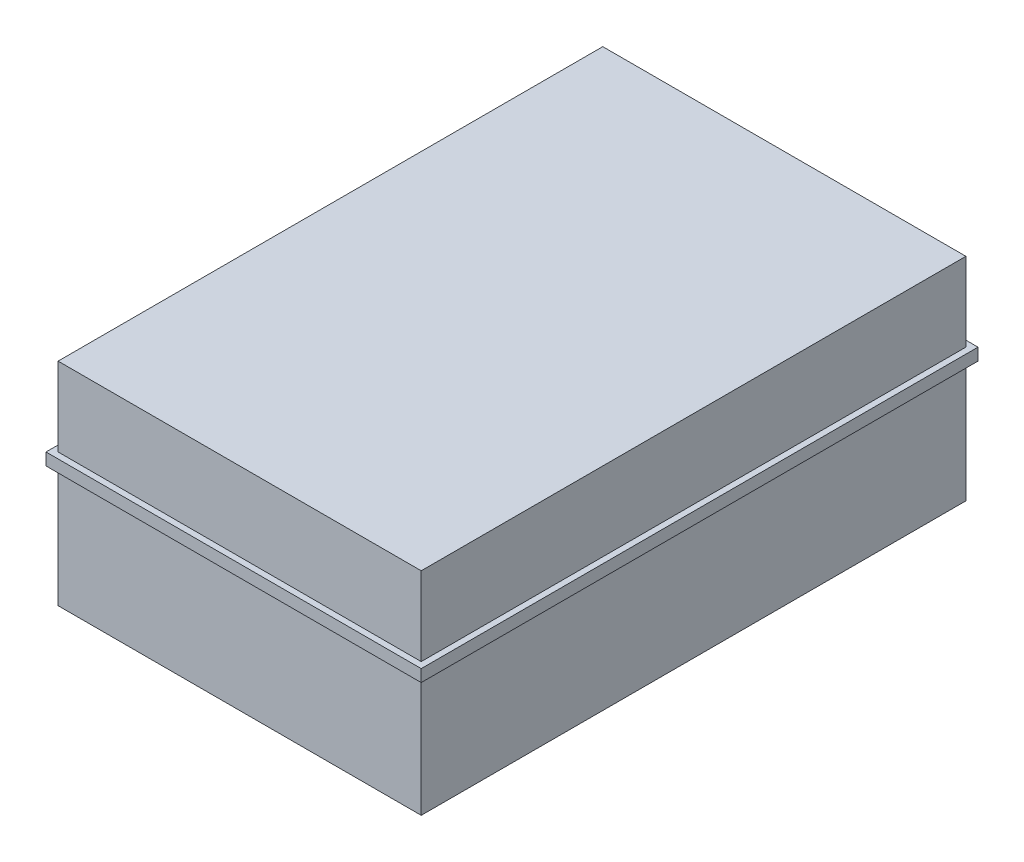
ISO-10303-21;
HEADER;
FILE_DESCRIPTION(('STEP AP214'),'2;1');
FILE_NAME('part.step','',(''),(''),'','','');
FILE_SCHEMA(('AUTOMOTIVE_DESIGN { 1 0 10303 214 1 1 1 1 }'));
ENDSEC;
DATA;
#1=APPLICATION_CONTEXT('core data for automotive mechanical design processes');
#2=APPLICATION_PROTOCOL_DEFINITION('international standard','automotive_design',2000,#1);
#3=PRODUCT_CONTEXT('',#1,'mechanical');
#4=PRODUCT('Part','Part','',(#3));
#5=PRODUCT_RELATED_PRODUCT_CATEGORY('part','',(#4));
#6=PRODUCT_DEFINITION_FORMATION('','',#4);
#7=PRODUCT_DEFINITION_CONTEXT('part definition',#1,'design');
#8=PRODUCT_DEFINITION('design','',#6,#7);
#9=PRODUCT_DEFINITION_SHAPE('','',#8);
#10=(LENGTH_UNIT() NAMED_UNIT(*) SI_UNIT(.MILLI.,.METRE.));
#11=(NAMED_UNIT(*) PLANE_ANGLE_UNIT() SI_UNIT($,.RADIAN.));
#12=(NAMED_UNIT(*) SI_UNIT($,.STERADIAN.) SOLID_ANGLE_UNIT());
#13=UNCERTAINTY_MEASURE_WITH_UNIT(LENGTH_MEASURE(1.E-05),#10,'distance_accuracy_value','');
#14=(GEOMETRIC_REPRESENTATION_CONTEXT(3) GLOBAL_UNCERTAINTY_ASSIGNED_CONTEXT((#13)) GLOBAL_UNIT_ASSIGNED_CONTEXT((#10,
#11,#12)) REPRESENTATION_CONTEXT('',''));
#15=CARTESIAN_POINT('',(0.,0.,0.));
#16=DIRECTION('',(0.,0.,1.));
#17=DIRECTION('',(1.,0.,0.));
#18=AXIS2_PLACEMENT_3D('',#15,#16,#17);
#19=CARTESIAN_POINT('',(62.,4.,0.));
#20=DIRECTION('',(1.,0.,0.));
#21=DIRECTION('',(0.,0.,-1.));
#22=AXIS2_PLACEMENT_3D('',#19,#20,#21);
#23=PLANE('',#22);
#24=DIRECTION('',(0.,0.,1.));
#25=VECTOR('',#24,1.);
#26=CARTESIAN_POINT('',(62.,0.,0.));
#27=LINE('',#26,#25);
#28=CARTESIAN_POINT('',(62.,0.,-91.5977047750075));
#29=VERTEX_POINT('',#28);
#30=CARTESIAN_POINT('',(62.,0.,92.4022952249925));
#31=VERTEX_POINT('',#30);
#32=EDGE_CURVE('E163',#29,#31,#27,.T.);
#33=ORIENTED_EDGE('',*,*,#32,.F.);
#34=DIRECTION('',(0.,-1.,0.));
#35=VECTOR('',#34,1.);
#36=CARTESIAN_POINT('',(62.,4.,-91.5977047750075));
#37=LINE('',#36,#35);
#38=CARTESIAN_POINT('',(62.,4.,-91.5977047750075));
#39=VERTEX_POINT('',#38);
#40=EDGE_CURVE('E11',#39,#29,#37,.T.);
#41=ORIENTED_EDGE('',*,*,#40,.F.);
#42=DIRECTION('',(0.,0.,1.));
#43=VECTOR('',#42,1.);
#44=CARTESIAN_POINT('',(62.,4.,0.));
#45=LINE('',#44,#43);
#46=CARTESIAN_POINT('',(62.,4.,92.4022952249925));
#47=VERTEX_POINT('',#46);
#48=EDGE_CURVE('E146',#39,#47,#45,.T.);
#49=ORIENTED_EDGE('',*,*,#48,.T.);
#50=DIRECTION('',(0.,-1.,0.));
#51=VECTOR('',#50,1.);
#52=CARTESIAN_POINT('',(62.,4.,92.4022952249925));
#53=LINE('',#52,#51);
#54=EDGE_CURVE('E78',#47,#31,#53,.T.);
#55=ORIENTED_EDGE('',*,*,#54,.T.);
#56=EDGE_LOOP('',(#33,#41,#49,#55));
#57=FACE_BOUND('',#56,.T.);
#58=ADVANCED_FACE('F41',(#57),#23,.T.);
#59=CARTESIAN_POINT('',(0.,4.,-91.5977047750075));
#60=DIRECTION('',(0.,0.,1.));
#61=DIRECTION('',(1.,0.,0.));
#62=AXIS2_PLACEMENT_3D('',#59,#60,#61);
#63=PLANE('',#62);
#64=DIRECTION('',(-1.,0.,0.));
#65=VECTOR('',#64,1.);
#66=CARTESIAN_POINT('',(0.,0.,-91.5977047750075));
#67=LINE('',#66,#65);
#68=CARTESIAN_POINT('',(-62.,0.,-91.5977047750075));
#69=VERTEX_POINT('',#68);
#70=EDGE_CURVE('E166',#29,#69,#67,.T.);
#71=ORIENTED_EDGE('',*,*,#70,.T.);
#72=DIRECTION('',(0.,-1.,0.));
#73=VECTOR('',#72,1.);
#74=CARTESIAN_POINT('',(-62.,4.,-91.5977047750075));
#75=LINE('',#74,#73);
#76=CARTESIAN_POINT('',(-62.,4.,-91.5977047750075));
#77=VERTEX_POINT('',#76);
#78=EDGE_CURVE('E50',#77,#69,#75,.T.);
#79=ORIENTED_EDGE('',*,*,#78,.F.);
#80=DIRECTION('',(-1.,0.,0.));
#81=VECTOR('',#80,1.);
#82=CARTESIAN_POINT('',(0.,4.,-91.5977047750075));
#83=LINE('',#82,#81);
#84=EDGE_CURVE('E149',#39,#77,#83,.T.);
#85=ORIENTED_EDGE('',*,*,#84,.F.);
#86=ORIENTED_EDGE('',*,*,#40,.T.);
#87=EDGE_LOOP('',(#71,#79,#85,#86));
#88=FACE_BOUND('',#87,.T.);
#89=ADVANCED_FACE('F215',(#88),#63,.F.);
#90=CARTESIAN_POINT('',(-62.,4.,0.));
#91=DIRECTION('',(1.,0.,0.));
#92=DIRECTION('',(0.,0.,-1.));
#93=AXIS2_PLACEMENT_3D('',#90,#91,#92);
#94=PLANE('',#93);
#95=DIRECTION('',(0.,0.,1.));
#96=VECTOR('',#95,1.);
#97=CARTESIAN_POINT('',(-62.,0.,0.));
#98=LINE('',#97,#96);
#99=CARTESIAN_POINT('',(-62.,0.,92.4022952249925));
#100=VERTEX_POINT('',#99);
#101=EDGE_CURVE('E170',#69,#100,#98,.T.);
#102=ORIENTED_EDGE('',*,*,#101,.T.);
#103=DIRECTION('',(0.,-1.,0.));
#104=VECTOR('',#103,1.);
#105=CARTESIAN_POINT('',(-62.,4.,92.4022952249925));
#106=LINE('',#105,#104);
#107=CARTESIAN_POINT('',(-62.,4.,92.4022952249925));
#108=VERTEX_POINT('',#107);
#109=EDGE_CURVE('E194',#108,#100,#106,.T.);
#110=ORIENTED_EDGE('',*,*,#109,.F.);
#111=DIRECTION('',(0.,0.,1.));
#112=VECTOR('',#111,1.);
#113=CARTESIAN_POINT('',(-62.,4.,0.));
#114=LINE('',#113,#112);
#115=EDGE_CURVE('E153',#77,#108,#114,.T.);
#116=ORIENTED_EDGE('',*,*,#115,.F.);
#117=ORIENTED_EDGE('',*,*,#78,.T.);
#118=EDGE_LOOP('',(#102,#110,#116,#117));
#119=FACE_BOUND('',#118,.T.);
#120=ADVANCED_FACE('F202',(#119),#94,.F.);
#121=CARTESIAN_POINT('',(0.,4.,92.4022952249925));
#122=DIRECTION('',(0.,0.,1.));
#123=DIRECTION('',(1.,0.,0.));
#124=AXIS2_PLACEMENT_3D('',#121,#122,#123);
#125=PLANE('',#124);
#126=DIRECTION('',(-1.,0.,0.));
#127=VECTOR('',#126,1.);
#128=CARTESIAN_POINT('',(0.,0.,92.4022952249925));
#129=LINE('',#128,#127);
#130=EDGE_CURVE('E174',#31,#100,#129,.T.);
#131=ORIENTED_EDGE('',*,*,#130,.F.);
#132=ORIENTED_EDGE('',*,*,#54,.F.);
#133=DIRECTION('',(-1.,0.,0.));
#134=VECTOR('',#133,1.);
#135=CARTESIAN_POINT('',(0.,4.,92.4022952249925));
#136=LINE('',#135,#134);
#137=EDGE_CURVE('E114',#47,#108,#136,.T.);
#138=ORIENTED_EDGE('',*,*,#137,.T.);
#139=ORIENTED_EDGE('',*,*,#109,.T.);
#140=EDGE_LOOP('',(#131,#132,#138,#139));
#141=FACE_BOUND('',#140,.T.);
#142=ADVANCED_FACE('F211',(#141),#125,.T.);
#143=CARTESIAN_POINT('',(0.,4.,0.));
#144=DIRECTION('',(0.,1.,0.));
#145=DIRECTION('',(0.,0.,1.));
#146=AXIS2_PLACEMENT_3D('',#143,#144,#145);
#147=PLANE('',#146);
#148=ORIENTED_EDGE('',*,*,#48,.F.);
#149=ORIENTED_EDGE('',*,*,#84,.T.);
#150=ORIENTED_EDGE('',*,*,#115,.T.);
#151=ORIENTED_EDGE('',*,*,#137,.F.);
#152=EDGE_LOOP('',(#148,#149,#150,#151));
#153=FACE_BOUND('',#152,.T.);
#154=DIRECTION('',(0.,0.,1.));
#155=VECTOR('',#154,1.);
#156=CARTESIAN_POINT('',(-60.,4.,0.));
#157=LINE('',#156,#155);
#158=CARTESIAN_POINT('',(-60.,4.,-89.5977047750075));
#159=VERTEX_POINT('',#158);
#160=CARTESIAN_POINT('',(-60.,4.,90.4022952249925));
#161=VERTEX_POINT('',#160);
#162=EDGE_CURVE('E103',#159,#161,#157,.T.);
#163=ORIENTED_EDGE('',*,*,#162,.F.);
#164=DIRECTION('',(-1.,0.,0.));
#165=VECTOR('',#164,1.);
#166=CARTESIAN_POINT('',(0.,4.,-89.5977047750075));
#167=LINE('',#166,#165);
#168=CARTESIAN_POINT('',(60.,4.,-89.5977047750075));
#169=VERTEX_POINT('',#168);
#170=EDGE_CURVE('E106',#169,#159,#167,.T.);
#171=ORIENTED_EDGE('',*,*,#170,.F.);
#172=DIRECTION('',(0.,0.,1.));
#173=VECTOR('',#172,1.);
#174=CARTESIAN_POINT('',(60.,4.,0.));
#175=LINE('',#174,#173);
#176=CARTESIAN_POINT('',(60.,4.,90.4022952249924));
#177=VERTEX_POINT('',#176);
#178=EDGE_CURVE('E58',#169,#177,#175,.T.);
#179=ORIENTED_EDGE('',*,*,#178,.T.);
#180=DIRECTION('',(-1.,0.,0.));
#181=VECTOR('',#180,1.);
#182=CARTESIAN_POINT('',(0.,4.,90.4022952249925));
#183=LINE('',#182,#181);
#184=EDGE_CURVE('E108',#177,#161,#183,.T.);
#185=ORIENTED_EDGE('',*,*,#184,.T.);
#186=EDGE_LOOP('',(#163,#171,#179,#185));
#187=FACE_BOUND('',#186,.T.);
#188=ADVANCED_FACE('F105',(#153,#187),#147,.T.);
#189=CARTESIAN_POINT('',(0.,0.,0.));
#190=DIRECTION('',(0.,1.,0.));
#191=DIRECTION('',(0.,0.,1.));
#192=AXIS2_PLACEMENT_3D('',#189,#190,#191);
#193=PLANE('',#192);
#194=ORIENTED_EDGE('',*,*,#32,.T.);
#195=ORIENTED_EDGE('',*,*,#130,.T.);
#196=ORIENTED_EDGE('',*,*,#101,.F.);
#197=ORIENTED_EDGE('',*,*,#70,.F.);
#198=EDGE_LOOP('',(#194,#195,#196,#197));
#199=FACE_BOUND('',#198,.T.);
#200=DIRECTION('',(0.,0.,1.));
#201=VECTOR('',#200,1.);
#202=CARTESIAN_POINT('',(-60.,0.,0.));
#203=LINE('',#202,#201);
#204=CARTESIAN_POINT('',(-60.,0.,-89.5977047750075));
#205=VERTEX_POINT('',#204);
#206=CARTESIAN_POINT('',(-60.,0.,90.4022952249925));
#207=VERTEX_POINT('',#206);
#208=EDGE_CURVE('E178',#205,#207,#203,.T.);
#209=ORIENTED_EDGE('',*,*,#208,.T.);
#210=DIRECTION('',(-1.,0.,0.));
#211=VECTOR('',#210,1.);
#212=CARTESIAN_POINT('',(0.,0.,90.4022952249925));
#213=LINE('',#212,#211);
#214=CARTESIAN_POINT('',(60.,0.,90.4022952249924));
#215=VERTEX_POINT('',#214);
#216=EDGE_CURVE('E150',#215,#207,#213,.T.);
#217=ORIENTED_EDGE('',*,*,#216,.F.);
#218=DIRECTION('',(0.,0.,1.));
#219=VECTOR('',#218,1.);
#220=CARTESIAN_POINT('',(60.,0.,0.));
#221=LINE('',#220,#219);
#222=CARTESIAN_POINT('',(60.,0.,-89.5977047750075));
#223=VERTEX_POINT('',#222);
#224=EDGE_CURVE('E186',#223,#215,#221,.T.);
#225=ORIENTED_EDGE('',*,*,#224,.F.);
#226=DIRECTION('',(-1.,0.,0.));
#227=VECTOR('',#226,1.);
#228=CARTESIAN_POINT('',(0.,0.,-89.5977047750075));
#229=LINE('',#228,#227);
#230=EDGE_CURVE('E182',#223,#205,#229,.T.);
#231=ORIENTED_EDGE('',*,*,#230,.T.);
#232=EDGE_LOOP('',(#209,#217,#225,#231));
#233=FACE_BOUND('',#232,.T.);
#234=ADVANCED_FACE('F207',(#199,#233),#193,.F.);
#235=CARTESIAN_POINT('',(0.,-40.,0.));
#236=DIRECTION('',(0.,1.,0.));
#237=DIRECTION('',(0.,0.,1.));
#238=AXIS2_PLACEMENT_3D('',#235,#236,#237);
#239=PLANE('',#238);
#240=DIRECTION('',(-1.,0.,0.));
#241=VECTOR('',#240,1.);
#242=CARTESIAN_POINT('',(0.,-40.,-89.5977047750075));
#243=LINE('',#242,#241);
#244=CARTESIAN_POINT('',(60.,-40.,-89.5977047750075));
#245=VERTEX_POINT('',#244);
#246=CARTESIAN_POINT('',(-60.,-40.,-89.5977047750075));
#247=VERTEX_POINT('',#246);
#248=EDGE_CURVE('E273',#245,#247,#243,.T.);
#249=ORIENTED_EDGE('',*,*,#248,.F.);
#250=DIRECTION('',(0.,0.,1.));
#251=VECTOR('',#250,1.);
#252=CARTESIAN_POINT('',(60.,-40.,0.));
#253=LINE('',#252,#251);
#254=CARTESIAN_POINT('',(60.,-40.,90.4022952249924));
#255=VERTEX_POINT('',#254);
#256=EDGE_CURVE('E134',#245,#255,#253,.T.);
#257=ORIENTED_EDGE('',*,*,#256,.T.);
#258=DIRECTION('',(-1.,0.,0.));
#259=VECTOR('',#258,1.);
#260=CARTESIAN_POINT('',(0.,-40.,90.4022952249925));
#261=LINE('',#260,#259);
#262=CARTESIAN_POINT('',(-60.,-40.,90.4022952249925));
#263=VERTEX_POINT('',#262);
#264=EDGE_CURVE('E141',#255,#263,#261,.T.);
#265=ORIENTED_EDGE('',*,*,#264,.T.);
#266=DIRECTION('',(0.,0.,1.));
#267=VECTOR('',#266,1.);
#268=CARTESIAN_POINT('',(-60.,-40.,0.));
#269=LINE('',#268,#267);
#270=EDGE_CURVE('E277',#247,#263,#269,.T.);
#271=ORIENTED_EDGE('',*,*,#270,.F.);
#272=EDGE_LOOP('',(#249,#257,#265,#271));
#273=FACE_BOUND('',#272,.T.);
#274=ADVANCED_FACE('F227',(#273),#239,.F.);
#275=CARTESIAN_POINT('',(-60.,-40.,0.));
#276=DIRECTION('',(-1.,0.,0.));
#277=DIRECTION('',(0.,0.,1.));
#278=AXIS2_PLACEMENT_3D('',#275,#276,#277);
#279=PLANE('',#278);
#280=ORIENTED_EDGE('',*,*,#208,.F.);
#281=DIRECTION('',(0.,1.,0.));
#282=VECTOR('',#281,1.);
#283=CARTESIAN_POINT('',(-60.,-40.,-89.5977047750075));
#284=LINE('',#283,#282);
#285=EDGE_CURVE('E133',#247,#205,#284,.T.);
#286=ORIENTED_EDGE('',*,*,#285,.F.);
#287=ORIENTED_EDGE('',*,*,#270,.T.);
#288=DIRECTION('',(0.,1.,0.));
#289=VECTOR('',#288,1.);
#290=CARTESIAN_POINT('',(-60.,-40.,90.4022952249925));
#291=LINE('',#290,#289);
#292=EDGE_CURVE('E86',#263,#207,#291,.T.);
#293=ORIENTED_EDGE('',*,*,#292,.T.);
#294=EDGE_LOOP('',(#280,#286,#287,#293));
#295=FACE_BOUND('',#294,.T.);
#296=ADVANCED_FACE('F238',(#295),#279,.T.);
#297=CARTESIAN_POINT('',(0.,-40.,90.4022952249925));
#298=DIRECTION('',(0.,0.,-1.));
#299=DIRECTION('',(-1.,0.,0.));
#300=AXIS2_PLACEMENT_3D('',#297,#298,#299);
#301=PLANE('',#300);
#302=DIRECTION('',(0.,1.,0.));
#303=VECTOR('',#302,1.);
#304=CARTESIAN_POINT('',(60.,-40.,90.4022952249924));
#305=LINE('',#304,#303);
#306=EDGE_CURVE('E285',#255,#215,#305,.T.);
#307=ORIENTED_EDGE('',*,*,#306,.T.);
#308=ORIENTED_EDGE('',*,*,#216,.T.);
#309=ORIENTED_EDGE('',*,*,#292,.F.);
#310=ORIENTED_EDGE('',*,*,#264,.F.);
#311=EDGE_LOOP('',(#307,#308,#309,#310));
#312=FACE_BOUND('',#311,.T.);
#313=ADVANCED_FACE('F242',(#312),#301,.F.);
#314=CARTESIAN_POINT('',(60.,-40.,0.));
#315=DIRECTION('',(-1.,0.,0.));
#316=DIRECTION('',(0.,0.,1.));
#317=AXIS2_PLACEMENT_3D('',#314,#315,#316);
#318=PLANE('',#317);
#319=DIRECTION('',(0.,1.,0.));
#320=VECTOR('',#319,1.);
#321=CARTESIAN_POINT('',(60.,-40.,-89.5977047750075));
#322=LINE('',#321,#320);
#323=EDGE_CURVE('E167',#245,#223,#322,.T.);
#324=ORIENTED_EDGE('',*,*,#323,.T.);
#325=ORIENTED_EDGE('',*,*,#224,.T.);
#326=ORIENTED_EDGE('',*,*,#306,.F.);
#327=ORIENTED_EDGE('',*,*,#256,.F.);
#328=EDGE_LOOP('',(#324,#325,#326,#327));
#329=FACE_BOUND('',#328,.T.);
#330=ADVANCED_FACE('F246',(#329),#318,.F.);
#331=CARTESIAN_POINT('',(0.,-40.,-89.5977047750075));
#332=DIRECTION('',(0.,0.,-1.));
#333=DIRECTION('',(-1.,0.,0.));
#334=AXIS2_PLACEMENT_3D('',#331,#332,#333);
#335=PLANE('',#334);
#336=ORIENTED_EDGE('',*,*,#230,.F.);
#337=ORIENTED_EDGE('',*,*,#323,.F.);
#338=ORIENTED_EDGE('',*,*,#248,.T.);
#339=ORIENTED_EDGE('',*,*,#285,.T.);
#340=EDGE_LOOP('',(#336,#337,#338,#339));
#341=FACE_BOUND('',#340,.T.);
#342=ADVANCED_FACE('F233',(#341),#335,.T.);
#343=CARTESIAN_POINT('',(60.,30.,-89.5977047750075));
#344=VERTEX_POINT('',#343);
#345=EDGE_CURVE('E125',#169,#344,#322,.T.);
#346=ORIENTED_EDGE('',*,*,#345,.F.);
#347=ORIENTED_EDGE('',*,*,#170,.T.);
#348=CARTESIAN_POINT('',(-60.,30.,-89.5977047750075));
#349=VERTEX_POINT('',#348);
#350=EDGE_CURVE('E122',#159,#349,#284,.T.);
#351=ORIENTED_EDGE('',*,*,#350,.T.);
#352=DIRECTION('',(-1.,0.,0.));
#353=VECTOR('',#352,1.);
#354=CARTESIAN_POINT('',(0.,30.,-89.5977047750075));
#355=LINE('',#354,#353);
#356=EDGE_CURVE('E255',#344,#349,#355,.T.);
#357=ORIENTED_EDGE('',*,*,#356,.F.);
#358=EDGE_LOOP('',(#346,#347,#351,#357));
#359=FACE_BOUND('',#358,.T.);
#360=ADVANCED_FACE('F119',(#359),#335,.T.);
#361=ORIENTED_EDGE('',*,*,#178,.F.);
#362=ORIENTED_EDGE('',*,*,#345,.T.);
#363=DIRECTION('',(0.,0.,1.));
#364=VECTOR('',#363,1.);
#365=CARTESIAN_POINT('',(60.,30.,0.));
#366=LINE('',#365,#364);
#367=CARTESIAN_POINT('',(60.,30.,90.4022952249924));
#368=VERTEX_POINT('',#367);
#369=EDGE_CURVE('E261',#344,#368,#366,.T.);
#370=ORIENTED_EDGE('',*,*,#369,.T.);
#371=EDGE_CURVE('E288',#177,#368,#305,.T.);
#372=ORIENTED_EDGE('',*,*,#371,.F.);
#373=EDGE_LOOP('',(#361,#362,#370,#372));
#374=FACE_BOUND('',#373,.T.);
#375=ADVANCED_FACE('F232',(#374),#318,.F.);
#376=ORIENTED_EDGE('',*,*,#184,.F.);
#377=ORIENTED_EDGE('',*,*,#371,.T.);
#378=DIRECTION('',(-1.,0.,0.));
#379=VECTOR('',#378,1.);
#380=CARTESIAN_POINT('',(0.,30.,90.4022952249925));
#381=LINE('',#380,#379);
#382=CARTESIAN_POINT('',(-60.,30.,90.4022952249925));
#383=VERTEX_POINT('',#382);
#384=EDGE_CURVE('E266',#368,#383,#381,.T.);
#385=ORIENTED_EDGE('',*,*,#384,.T.);
#386=EDGE_CURVE('E139',#161,#383,#291,.T.);
#387=ORIENTED_EDGE('',*,*,#386,.F.);
#388=EDGE_LOOP('',(#376,#377,#385,#387));
#389=FACE_BOUND('',#388,.T.);
#390=ADVANCED_FACE('F237',(#389),#301,.F.);
#391=ORIENTED_EDGE('',*,*,#350,.F.);
#392=ORIENTED_EDGE('',*,*,#162,.T.);
#393=ORIENTED_EDGE('',*,*,#386,.T.);
#394=DIRECTION('',(0.,0.,1.));
#395=VECTOR('',#394,1.);
#396=CARTESIAN_POINT('',(-60.,30.,0.));
#397=LINE('',#396,#395);
#398=EDGE_CURVE('E130',#349,#383,#397,.T.);
#399=ORIENTED_EDGE('',*,*,#398,.F.);
#400=EDGE_LOOP('',(#391,#392,#393,#399));
#401=FACE_BOUND('',#400,.T.);
#402=ADVANCED_FACE('F128',(#401),#279,.T.);
#403=CARTESIAN_POINT('',(0.,30.,0.));
#404=DIRECTION('',(0.,1.,0.));
#405=DIRECTION('',(0.,0.,1.));
#406=AXIS2_PLACEMENT_3D('',#403,#404,#405);
#407=PLANE('',#406);
#408=ORIENTED_EDGE('',*,*,#356,.T.);
#409=ORIENTED_EDGE('',*,*,#398,.T.);
#410=ORIENTED_EDGE('',*,*,#384,.F.);
#411=ORIENTED_EDGE('',*,*,#369,.F.);
#412=EDGE_LOOP('',(#408,#409,#410,#411));
#413=FACE_BOUND('',#412,.T.);
#414=ADVANCED_FACE('F236',(#413),#407,.T.);
#415=CLOSED_SHELL('',(#58,#89,#120,#142,#188,#234,#274,#296,#313,#330,#342,#360,#375,#390,#402,#414));
#416=MANIFOLD_SOLID_BREP('B2',#415);
#417=ADVANCED_BREP_SHAPE_REPRESENTATION('',(#18,#416),#14);
#418=SHAPE_DEFINITION_REPRESENTATION(#9,#417);
ENDSEC;
END-ISO-10303-21;
